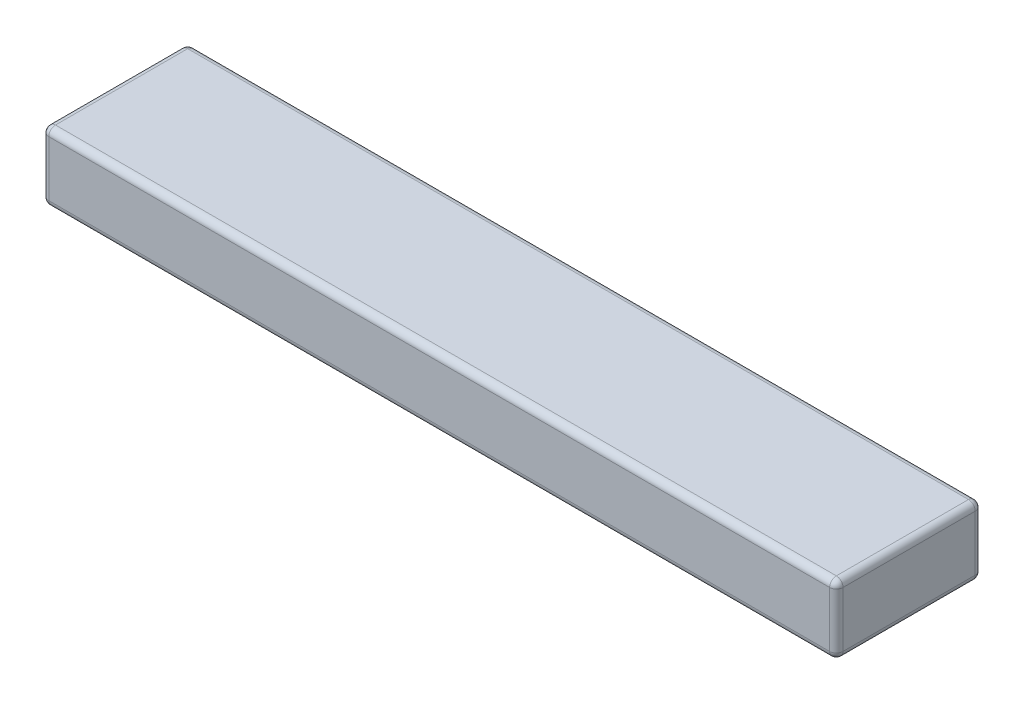
ISO-10303-21;
HEADER;
FILE_DESCRIPTION(('STEP AP214'),'2;1');
FILE_NAME('part.step','',(''),(''),'','','');
FILE_SCHEMA(('AUTOMOTIVE_DESIGN { 1 0 10303 214 1 1 1 1 }'));
ENDSEC;
DATA;
#1=APPLICATION_CONTEXT('core data for automotive mechanical design processes');
#2=APPLICATION_PROTOCOL_DEFINITION('international standard','automotive_design',2000,#1);
#3=PRODUCT_CONTEXT('',#1,'mechanical');
#4=PRODUCT('Part','Part','',(#3));
#5=PRODUCT_RELATED_PRODUCT_CATEGORY('part','',(#4));
#6=PRODUCT_DEFINITION_FORMATION('','',#4);
#7=PRODUCT_DEFINITION_CONTEXT('part definition',#1,'design');
#8=PRODUCT_DEFINITION('design','',#6,#7);
#9=PRODUCT_DEFINITION_SHAPE('','',#8);
#10=(LENGTH_UNIT() NAMED_UNIT(*) SI_UNIT(.MILLI.,.METRE.));
#11=(NAMED_UNIT(*) PLANE_ANGLE_UNIT() SI_UNIT($,.RADIAN.));
#12=(NAMED_UNIT(*) SI_UNIT($,.STERADIAN.) SOLID_ANGLE_UNIT());
#13=UNCERTAINTY_MEASURE_WITH_UNIT(LENGTH_MEASURE(1.E-05),#10,'distance_accuracy_value','');
#14=(GEOMETRIC_REPRESENTATION_CONTEXT(3) GLOBAL_UNCERTAINTY_ASSIGNED_CONTEXT((#13)) GLOBAL_UNIT_ASSIGNED_CONTEXT((#10,
#11,#12)) REPRESENTATION_CONTEXT('',''));
#15=CARTESIAN_POINT('',(0.,0.,0.));
#16=DIRECTION('',(0.,0.,1.));
#17=DIRECTION('',(1.,0.,0.));
#18=AXIS2_PLACEMENT_3D('',#15,#16,#17);
#19=CARTESIAN_POINT('',(-150.,26.,27.5));
#20=DIRECTION('',(1.,0.,0.));
#21=DIRECTION('',(0.,0.,-1.));
#22=AXIS2_PLACEMENT_3D('',#19,#20,#21);
#23=PLANE('',#22);
#24=DIRECTION('',(0.,-1.,0.));
#25=VECTOR('',#24,1.);
#26=CARTESIAN_POINT('',(-150.,26.,-24.96));
#27=LINE('',#26,#25);
#28=CARTESIAN_POINT('',(-150.,23.46,-24.96));
#29=VERTEX_POINT('',#28);
#30=CARTESIAN_POINT('',(-150.,2.54,-24.96));
#31=VERTEX_POINT('',#30);
#32=EDGE_CURVE('E130',#29,#31,#27,.T.);
#33=ORIENTED_EDGE('',*,*,#32,.T.);
#34=DIRECTION('',(0.,0.,1.));
#35=VECTOR('',#34,1.);
#36=CARTESIAN_POINT('',(-150.,2.54,27.5));
#37=LINE('',#36,#35);
#38=CARTESIAN_POINT('',(-150.,2.54,24.96));
#39=VERTEX_POINT('',#38);
#40=EDGE_CURVE('E126',#31,#39,#37,.T.);
#41=ORIENTED_EDGE('',*,*,#40,.T.);
#42=DIRECTION('',(0.,-1.,0.));
#43=VECTOR('',#42,1.);
#44=CARTESIAN_POINT('',(-150.,26.,24.96));
#45=LINE('',#44,#43);
#46=CARTESIAN_POINT('',(-150.,23.46,24.96));
#47=VERTEX_POINT('',#46);
#48=EDGE_CURVE('E121',#39,#47,#45,.F.);
#49=ORIENTED_EDGE('',*,*,#48,.T.);
#50=DIRECTION('',(0.,0.,1.));
#51=VECTOR('',#50,1.);
#52=CARTESIAN_POINT('',(-150.,23.46,-27.5));
#53=LINE('',#52,#51);
#54=EDGE_CURVE('E123',#47,#29,#53,.F.);
#55=ORIENTED_EDGE('',*,*,#54,.T.);
#56=EDGE_LOOP('',(#33,#41,#49,#55));
#57=FACE_BOUND('',#56,.T.);
#58=ADVANCED_FACE('F33',(#57),#23,.F.);
#59=CARTESIAN_POINT('',(150.,26.,27.5));
#60=DIRECTION('',(0.,0.,-1.));
#61=DIRECTION('',(-1.,0.,0.));
#62=AXIS2_PLACEMENT_3D('',#59,#60,#61);
#63=PLANE('',#62);
#64=DIRECTION('',(0.,-1.,0.));
#65=VECTOR('',#64,1.);
#66=CARTESIAN_POINT('',(-147.46,26.,27.5));
#67=LINE('',#66,#65);
#68=CARTESIAN_POINT('',(-147.46,23.46,27.5));
#69=VERTEX_POINT('',#68);
#70=CARTESIAN_POINT('',(-147.46,2.54,27.5));
#71=VERTEX_POINT('',#70);
#72=EDGE_CURVE('E152',#69,#71,#67,.T.);
#73=ORIENTED_EDGE('',*,*,#72,.T.);
#74=DIRECTION('',(1.,0.,0.));
#75=VECTOR('',#74,1.);
#76=CARTESIAN_POINT('',(150.,2.54,27.5));
#77=LINE('',#76,#75);
#78=CARTESIAN_POINT('',(147.46,2.54,27.5));
#79=VERTEX_POINT('',#78);
#80=EDGE_CURVE('E230',#71,#79,#77,.T.);
#81=ORIENTED_EDGE('',*,*,#80,.T.);
#82=DIRECTION('',(0.,-1.,0.));
#83=VECTOR('',#82,1.);
#84=CARTESIAN_POINT('',(147.46,26.,27.5));
#85=LINE('',#84,#83);
#86=CARTESIAN_POINT('',(147.46,23.46,27.5));
#87=VERTEX_POINT('',#86);
#88=EDGE_CURVE('E223',#79,#87,#85,.F.);
#89=ORIENTED_EDGE('',*,*,#88,.T.);
#90=DIRECTION('',(1.,0.,0.));
#91=VECTOR('',#90,1.);
#92=CARTESIAN_POINT('',(-150.,23.46,27.5));
#93=LINE('',#92,#91);
#94=EDGE_CURVE('E221',#87,#69,#93,.F.);
#95=ORIENTED_EDGE('',*,*,#94,.T.);
#96=EDGE_LOOP('',(#73,#81,#89,#95));
#97=FACE_BOUND('',#96,.T.);
#98=ADVANCED_FACE('F320',(#97),#63,.F.);
#99=CARTESIAN_POINT('',(150.,26.,27.5));
#100=DIRECTION('',(-1.,0.,0.));
#101=DIRECTION('',(0.,0.,1.));
#102=AXIS2_PLACEMENT_3D('',#99,#100,#101);
#103=PLANE('',#102);
#104=DIRECTION('',(0.,0.,-1.));
#105=VECTOR('',#104,1.);
#106=CARTESIAN_POINT('',(150.,2.54,27.5));
#107=LINE('',#106,#105);
#108=CARTESIAN_POINT('',(150.,2.54,24.96));
#109=VERTEX_POINT('',#108);
#110=CARTESIAN_POINT('',(150.,2.54,-24.96));
#111=VERTEX_POINT('',#110);
#112=EDGE_CURVE('E217',#109,#111,#107,.T.);
#113=ORIENTED_EDGE('',*,*,#112,.T.);
#114=DIRECTION('',(0.,-1.,0.));
#115=VECTOR('',#114,1.);
#116=CARTESIAN_POINT('',(150.,26.,-24.96));
#117=LINE('',#116,#115);
#118=CARTESIAN_POINT('',(150.,23.46,-24.96));
#119=VERTEX_POINT('',#118);
#120=EDGE_CURVE('E214',#111,#119,#117,.F.);
#121=ORIENTED_EDGE('',*,*,#120,.T.);
#122=DIRECTION('',(0.,0.,-1.));
#123=VECTOR('',#122,1.);
#124=CARTESIAN_POINT('',(150.,23.46,27.5));
#125=LINE('',#124,#123);
#126=CARTESIAN_POINT('',(150.,23.46,24.96));
#127=VERTEX_POINT('',#126);
#128=EDGE_CURVE('E207',#119,#127,#125,.F.);
#129=ORIENTED_EDGE('',*,*,#128,.T.);
#130=DIRECTION('',(0.,-1.,0.));
#131=VECTOR('',#130,1.);
#132=CARTESIAN_POINT('',(150.,26.,24.96));
#133=LINE('',#132,#131);
#134=EDGE_CURVE('E210',#127,#109,#133,.T.);
#135=ORIENTED_EDGE('',*,*,#134,.T.);
#136=EDGE_LOOP('',(#113,#121,#129,#135));
#137=FACE_BOUND('',#136,.T.);
#138=ADVANCED_FACE('F215',(#137),#103,.F.);
#139=CARTESIAN_POINT('',(150.,26.,-27.5));
#140=DIRECTION('',(0.,0.,1.));
#141=DIRECTION('',(1.,0.,0.));
#142=AXIS2_PLACEMENT_3D('',#139,#140,#141);
#143=PLANE('',#142);
#144=DIRECTION('',(-1.,0.,0.));
#145=VECTOR('',#144,1.);
#146=CARTESIAN_POINT('',(150.,2.54,-27.5));
#147=LINE('',#146,#145);
#148=CARTESIAN_POINT('',(147.46,2.54,-27.5));
#149=VERTEX_POINT('',#148);
#150=CARTESIAN_POINT('',(-147.46,2.54,-27.5));
#151=VERTEX_POINT('',#150);
#152=EDGE_CURVE('E279',#149,#151,#147,.T.);
#153=ORIENTED_EDGE('',*,*,#152,.T.);
#154=DIRECTION('',(0.,-1.,0.));
#155=VECTOR('',#154,1.);
#156=CARTESIAN_POINT('',(-147.46,26.,-27.5));
#157=LINE('',#156,#155);
#158=CARTESIAN_POINT('',(-147.46,23.46,-27.5));
#159=VERTEX_POINT('',#158);
#160=EDGE_CURVE('E211',#151,#159,#157,.F.);
#161=ORIENTED_EDGE('',*,*,#160,.T.);
#162=DIRECTION('',(-1.,0.,0.));
#163=VECTOR('',#162,1.);
#164=CARTESIAN_POINT('',(150.,23.46,-27.5));
#165=LINE('',#164,#163);
#166=CARTESIAN_POINT('',(147.46,23.46,-27.5));
#167=VERTEX_POINT('',#166);
#168=EDGE_CURVE('E272',#159,#167,#165,.F.);
#169=ORIENTED_EDGE('',*,*,#168,.T.);
#170=DIRECTION('',(0.,-1.,0.));
#171=VECTOR('',#170,1.);
#172=CARTESIAN_POINT('',(147.46,26.,-27.5));
#173=LINE('',#172,#171);
#174=EDGE_CURVE('E274',#167,#149,#173,.T.);
#175=ORIENTED_EDGE('',*,*,#174,.T.);
#176=EDGE_LOOP('',(#153,#161,#169,#175));
#177=FACE_BOUND('',#176,.T.);
#178=ADVANCED_FACE('F304',(#177),#143,.F.);
#179=CARTESIAN_POINT('',(-150.,26.,-27.5));
#180=DIRECTION('',(0.,1.,0.));
#181=DIRECTION('',(0.,0.,1.));
#182=AXIS2_PLACEMENT_3D('',#179,#180,#181);
#183=PLANE('',#182);
#184=DIRECTION('',(0.,0.,-1.));
#185=VECTOR('',#184,1.);
#186=CARTESIAN_POINT('',(147.46,26.,-27.5));
#187=LINE('',#186,#185);
#188=CARTESIAN_POINT('',(147.46,26.,24.96));
#189=VERTEX_POINT('',#188);
#190=CARTESIAN_POINT('',(147.46,26.,-24.96));
#191=VERTEX_POINT('',#190);
#192=EDGE_CURVE('E42',#189,#191,#187,.T.);
#193=ORIENTED_EDGE('',*,*,#192,.T.);
#194=DIRECTION('',(-1.,0.,0.));
#195=VECTOR('',#194,1.);
#196=CARTESIAN_POINT('',(-150.,26.,-24.96));
#197=LINE('',#196,#195);
#198=CARTESIAN_POINT('',(-147.46,26.,-24.96));
#199=VERTEX_POINT('',#198);
#200=EDGE_CURVE('E11',#191,#199,#197,.T.);
#201=ORIENTED_EDGE('',*,*,#200,.T.);
#202=DIRECTION('',(0.,0.,1.));
#203=VECTOR('',#202,1.);
#204=CARTESIAN_POINT('',(-147.46,26.,27.5));
#205=LINE('',#204,#203);
#206=CARTESIAN_POINT('',(-147.46,26.,24.96));
#207=VERTEX_POINT('',#206);
#208=EDGE_CURVE('E232',#199,#207,#205,.T.);
#209=ORIENTED_EDGE('',*,*,#208,.T.);
#210=DIRECTION('',(1.,0.,0.));
#211=VECTOR('',#210,1.);
#212=CARTESIAN_POINT('',(150.,26.,24.96));
#213=LINE('',#212,#211);
#214=EDGE_CURVE('E53',#207,#189,#213,.T.);
#215=ORIENTED_EDGE('',*,*,#214,.T.);
#216=EDGE_LOOP('',(#193,#201,#209,#215));
#217=FACE_BOUND('',#216,.T.);
#218=ADVANCED_FACE('F483',(#217),#183,.T.);
#219=CARTESIAN_POINT('',(-150.,0.,-27.5));
#220=DIRECTION('',(0.,1.,0.));
#221=DIRECTION('',(0.,0.,1.));
#222=AXIS2_PLACEMENT_3D('',#219,#220,#221);
#223=PLANE('',#222);
#224=DIRECTION('',(1.,0.,0.));
#225=VECTOR('',#224,1.);
#226=CARTESIAN_POINT('',(-150.,0.,24.96));
#227=LINE('',#226,#225);
#228=CARTESIAN_POINT('',(147.46,0.,24.96));
#229=VERTEX_POINT('',#228);
#230=CARTESIAN_POINT('',(-147.46,0.,24.96));
#231=VERTEX_POINT('',#230);
#232=EDGE_CURVE('E268',#229,#231,#227,.F.);
#233=ORIENTED_EDGE('',*,*,#232,.T.);
#234=DIRECTION('',(0.,0.,1.));
#235=VECTOR('',#234,1.);
#236=CARTESIAN_POINT('',(-147.46,0.,-27.5));
#237=LINE('',#236,#235);
#238=CARTESIAN_POINT('',(-147.46,0.,-24.96));
#239=VERTEX_POINT('',#238);
#240=EDGE_CURVE('E262',#231,#239,#237,.F.);
#241=ORIENTED_EDGE('',*,*,#240,.T.);
#242=DIRECTION('',(-1.,0.,0.));
#243=VECTOR('',#242,1.);
#244=CARTESIAN_POINT('',(-150.,0.,-24.96));
#245=LINE('',#244,#243);
#246=CARTESIAN_POINT('',(147.46,0.,-24.96));
#247=VERTEX_POINT('',#246);
#248=EDGE_CURVE('E256',#239,#247,#245,.F.);
#249=ORIENTED_EDGE('',*,*,#248,.T.);
#250=DIRECTION('',(0.,0.,-1.));
#251=VECTOR('',#250,1.);
#252=CARTESIAN_POINT('',(147.46,0.,-27.5));
#253=LINE('',#252,#251);
#254=EDGE_CURVE('E263',#247,#229,#253,.F.);
#255=ORIENTED_EDGE('',*,*,#254,.T.);
#256=EDGE_LOOP('',(#233,#241,#249,#255));
#257=FACE_BOUND('',#256,.T.);
#258=ADVANCED_FACE('F266',(#257),#223,.F.);
#259=CARTESIAN_POINT('',(147.46,23.46,-27.5));
#260=DIRECTION('',(0.,0.,1.));
#261=DIRECTION('',(1.,0.,0.));
#262=AXIS2_PLACEMENT_3D('',#259,#260,#261);
#263=CYLINDRICAL_SURFACE('',#262,2.54);
#264=CARTESIAN_POINT('',(147.46,23.46,-24.96));
#265=DIRECTION('',(0.,0.,-1.));
#266=DIRECTION('',(-1.,0.,0.));
#267=AXIS2_PLACEMENT_3D('',#264,#265,#266);
#268=CIRCLE('',#267,2.54);
#269=EDGE_CURVE('E37',#191,#119,#268,.T.);
#270=ORIENTED_EDGE('',*,*,#269,.F.);
#271=ORIENTED_EDGE('',*,*,#192,.F.);
#272=CARTESIAN_POINT('',(147.46,23.46,24.96));
#273=DIRECTION('',(0.,0.,1.));
#274=DIRECTION('',(1.,0.,0.));
#275=AXIS2_PLACEMENT_3D('',#272,#273,#274);
#276=CIRCLE('',#275,2.54);
#277=EDGE_CURVE('E192',#127,#189,#276,.T.);
#278=ORIENTED_EDGE('',*,*,#277,.F.);
#279=ORIENTED_EDGE('',*,*,#128,.F.);
#280=EDGE_LOOP('',(#270,#271,#278,#279));
#281=FACE_BOUND('',#280,.T.);
#282=ADVANCED_FACE('F35',(#281),#263,.T.);
#283=CARTESIAN_POINT('',(147.46,23.46,-24.96));
#284=DIRECTION('',(0.,0.,1.));
#285=DIRECTION('',(1.,0.,0.));
#286=AXIS2_PLACEMENT_3D('',#283,#284,#285);
#287=SPHERICAL_SURFACE('',#286,2.54);
#288=CARTESIAN_POINT('',(147.46,23.46,-24.96));
#289=DIRECTION('',(1.,0.,0.));
#290=DIRECTION('',(0.,0.,-1.));
#291=AXIS2_PLACEMENT_3D('',#288,#289,#290);
#292=CIRCLE('',#291,2.54);
#293=EDGE_CURVE('E188',#191,#167,#292,.F.);
#294=ORIENTED_EDGE('',*,*,#293,.F.);
#295=ORIENTED_EDGE('',*,*,#269,.T.);
#296=CARTESIAN_POINT('',(147.46,23.46,-24.96));
#297=DIRECTION('',(0.,1.,0.));
#298=DIRECTION('',(0.,0.,1.));
#299=AXIS2_PLACEMENT_3D('',#296,#297,#298);
#300=CIRCLE('',#299,2.54);
#301=EDGE_CURVE('E191',#167,#119,#300,.F.);
#302=ORIENTED_EDGE('',*,*,#301,.F.);
#303=EDGE_LOOP('',(#294,#295,#302));
#304=FACE_BOUND('',#303,.T.);
#305=ADVANCED_FACE('F203',(#304),#287,.T.);
#306=CARTESIAN_POINT('',(147.46,23.46,24.96));
#307=DIRECTION('',(0.,0.,1.));
#308=DIRECTION('',(1.,0.,0.));
#309=AXIS2_PLACEMENT_3D('',#306,#307,#308);
#310=SPHERICAL_SURFACE('',#309,2.54);
#311=CARTESIAN_POINT('',(147.46,23.46,24.96));
#312=DIRECTION('',(0.,1.,0.));
#313=DIRECTION('',(0.,0.,1.));
#314=AXIS2_PLACEMENT_3D('',#311,#312,#313);
#315=CIRCLE('',#314,2.54);
#316=EDGE_CURVE('E182',#127,#87,#315,.F.);
#317=ORIENTED_EDGE('',*,*,#316,.F.);
#318=ORIENTED_EDGE('',*,*,#277,.T.);
#319=CARTESIAN_POINT('',(147.46,23.46,24.96));
#320=DIRECTION('',(1.,0.,0.));
#321=DIRECTION('',(0.,0.,-1.));
#322=AXIS2_PLACEMENT_3D('',#319,#320,#321);
#323=CIRCLE('',#322,2.54);
#324=EDGE_CURVE('E185',#87,#189,#323,.F.);
#325=ORIENTED_EDGE('',*,*,#324,.F.);
#326=EDGE_LOOP('',(#317,#318,#325));
#327=FACE_BOUND('',#326,.T.);
#328=ADVANCED_FACE('F456',(#327),#310,.T.);
#329=CARTESIAN_POINT('',(147.46,26.,-24.96));
#330=DIRECTION('',(0.,-1.,0.));
#331=DIRECTION('',(0.,0.,-1.));
#332=AXIS2_PLACEMENT_3D('',#329,#330,#331);
#333=CYLINDRICAL_SURFACE('',#332,2.54);
#334=ORIENTED_EDGE('',*,*,#301,.T.);
#335=ORIENTED_EDGE('',*,*,#120,.F.);
#336=CARTESIAN_POINT('',(147.46,2.54,-24.96));
#337=DIRECTION('',(0.,-1.,0.));
#338=DIRECTION('',(0.,0.,-1.));
#339=AXIS2_PLACEMENT_3D('',#336,#337,#338);
#340=CIRCLE('',#339,2.54);
#341=EDGE_CURVE('E176',#149,#111,#340,.T.);
#342=ORIENTED_EDGE('',*,*,#341,.F.);
#343=ORIENTED_EDGE('',*,*,#174,.F.);
#344=EDGE_LOOP('',(#334,#335,#342,#343));
#345=FACE_BOUND('',#344,.T.);
#346=ADVANCED_FACE('F306',(#345),#333,.T.);
#347=CARTESIAN_POINT('',(-150.,23.46,-24.96));
#348=DIRECTION('',(1.,0.,0.));
#349=DIRECTION('',(0.,0.,-1.));
#350=AXIS2_PLACEMENT_3D('',#347,#348,#349);
#351=CYLINDRICAL_SURFACE('',#350,2.54);
#352=ORIENTED_EDGE('',*,*,#293,.T.);
#353=ORIENTED_EDGE('',*,*,#168,.F.);
#354=CARTESIAN_POINT('',(-147.46,23.46,-24.96));
#355=DIRECTION('',(-1.,0.,0.));
#356=DIRECTION('',(0.,0.,1.));
#357=AXIS2_PLACEMENT_3D('',#354,#355,#356);
#358=CIRCLE('',#357,2.54);
#359=EDGE_CURVE('E173',#199,#159,#358,.T.);
#360=ORIENTED_EDGE('',*,*,#359,.F.);
#361=ORIENTED_EDGE('',*,*,#200,.F.);
#362=EDGE_LOOP('',(#352,#353,#360,#361));
#363=FACE_BOUND('',#362,.T.);
#364=ADVANCED_FACE('F440',(#363),#351,.T.);
#365=CARTESIAN_POINT('',(-147.46,23.46,-27.5));
#366=DIRECTION('',(0.,0.,-1.));
#367=DIRECTION('',(-1.,0.,0.));
#368=AXIS2_PLACEMENT_3D('',#365,#366,#367);
#369=CYLINDRICAL_SURFACE('',#368,2.54);
#370=CARTESIAN_POINT('',(-147.46,23.46,24.96));
#371=DIRECTION('',(0.,0.,1.));
#372=DIRECTION('',(1.,0.,0.));
#373=AXIS2_PLACEMENT_3D('',#370,#371,#372);
#374=CIRCLE('',#373,2.54);
#375=EDGE_CURVE('E137',#207,#47,#374,.T.);
#376=ORIENTED_EDGE('',*,*,#375,.F.);
#377=ORIENTED_EDGE('',*,*,#208,.F.);
#378=CARTESIAN_POINT('',(-147.46,23.46,-24.96));
#379=DIRECTION('',(0.,0.,-1.));
#380=DIRECTION('',(-1.,0.,0.));
#381=AXIS2_PLACEMENT_3D('',#378,#379,#380);
#382=CIRCLE('',#381,2.54);
#383=EDGE_CURVE('E139',#29,#199,#382,.T.);
#384=ORIENTED_EDGE('',*,*,#383,.F.);
#385=ORIENTED_EDGE('',*,*,#54,.F.);
#386=EDGE_LOOP('',(#376,#377,#384,#385));
#387=FACE_BOUND('',#386,.T.);
#388=ADVANCED_FACE('F135',(#387),#369,.T.);
#389=CARTESIAN_POINT('',(-150.,23.46,24.96));
#390=DIRECTION('',(-1.,0.,0.));
#391=DIRECTION('',(0.,0.,1.));
#392=AXIS2_PLACEMENT_3D('',#389,#390,#391);
#393=CYLINDRICAL_SURFACE('',#392,2.54);
#394=ORIENTED_EDGE('',*,*,#324,.T.);
#395=ORIENTED_EDGE('',*,*,#214,.F.);
#396=CARTESIAN_POINT('',(-147.46,23.46,24.96));
#397=DIRECTION('',(-1.,0.,0.));
#398=DIRECTION('',(0.,-1.,0.));
#399=AXIS2_PLACEMENT_3D('',#396,#397,#398);
#400=CIRCLE('',#399,2.54);
#401=EDGE_CURVE('E148',#69,#207,#400,.T.);
#402=ORIENTED_EDGE('',*,*,#401,.F.);
#403=ORIENTED_EDGE('',*,*,#94,.F.);
#404=EDGE_LOOP('',(#394,#395,#402,#403));
#405=FACE_BOUND('',#404,.T.);
#406=ADVANCED_FACE('F424',(#405),#393,.T.);
#407=CARTESIAN_POINT('',(147.46,26.,24.96));
#408=DIRECTION('',(0.,-1.,0.));
#409=DIRECTION('',(0.,0.,-1.));
#410=AXIS2_PLACEMENT_3D('',#407,#408,#409);
#411=CYLINDRICAL_SURFACE('',#410,2.54);
#412=ORIENTED_EDGE('',*,*,#316,.T.);
#413=ORIENTED_EDGE('',*,*,#88,.F.);
#414=CARTESIAN_POINT('',(147.46,2.54,24.96));
#415=DIRECTION('',(0.,-1.,0.));
#416=DIRECTION('',(0.,0.,-1.));
#417=AXIS2_PLACEMENT_3D('',#414,#415,#416);
#418=CIRCLE('',#417,2.54);
#419=EDGE_CURVE('E168',#109,#79,#418,.T.);
#420=ORIENTED_EDGE('',*,*,#419,.F.);
#421=ORIENTED_EDGE('',*,*,#134,.F.);
#422=EDGE_LOOP('',(#412,#413,#420,#421));
#423=FACE_BOUND('',#422,.T.);
#424=ADVANCED_FACE('F290',(#423),#411,.T.);
#425=CARTESIAN_POINT('',(147.46,2.54,27.5));
#426=DIRECTION('',(0.,0.,-1.));
#427=DIRECTION('',(-1.,0.,0.));
#428=AXIS2_PLACEMENT_3D('',#425,#426,#427);
#429=CYLINDRICAL_SURFACE('',#428,2.54);
#430=CARTESIAN_POINT('',(147.46,2.54,-24.96));
#431=DIRECTION('',(0.,0.,-1.));
#432=DIRECTION('',(-1.,0.,0.));
#433=AXIS2_PLACEMENT_3D('',#430,#431,#432);
#434=CIRCLE('',#433,2.54);
#435=EDGE_CURVE('E179',#111,#247,#434,.T.);
#436=ORIENTED_EDGE('',*,*,#435,.F.);
#437=ORIENTED_EDGE('',*,*,#112,.F.);
#438=CARTESIAN_POINT('',(147.46,2.54,24.96));
#439=DIRECTION('',(0.,0.,1.));
#440=DIRECTION('',(1.,0.,0.));
#441=AXIS2_PLACEMENT_3D('',#438,#439,#440);
#442=CIRCLE('',#441,2.54);
#443=EDGE_CURVE('E165',#229,#109,#442,.T.);
#444=ORIENTED_EDGE('',*,*,#443,.F.);
#445=ORIENTED_EDGE('',*,*,#254,.F.);
#446=EDGE_LOOP('',(#436,#437,#444,#445));
#447=FACE_BOUND('',#446,.T.);
#448=ADVANCED_FACE('F287',(#447),#429,.T.);
#449=CARTESIAN_POINT('',(147.46,2.54,-24.96));
#450=DIRECTION('',(0.,0.,1.));
#451=DIRECTION('',(1.,0.,0.));
#452=AXIS2_PLACEMENT_3D('',#449,#450,#451);
#453=SPHERICAL_SURFACE('',#452,2.54);
#454=ORIENTED_EDGE('',*,*,#341,.T.);
#455=ORIENTED_EDGE('',*,*,#435,.T.);
#456=CARTESIAN_POINT('',(147.46,2.54,-24.96));
#457=DIRECTION('',(1.,0.,0.));
#458=DIRECTION('',(0.,0.,-1.));
#459=AXIS2_PLACEMENT_3D('',#456,#457,#458);
#460=CIRCLE('',#459,2.54);
#461=EDGE_CURVE('E156',#149,#247,#460,.F.);
#462=ORIENTED_EDGE('',*,*,#461,.F.);
#463=EDGE_LOOP('',(#454,#455,#462));
#464=FACE_BOUND('',#463,.T.);
#465=ADVANCED_FACE('F308',(#464),#453,.T.);
#466=CARTESIAN_POINT('',(-147.46,23.46,-24.96));
#467=DIRECTION('',(0.,0.,1.));
#468=DIRECTION('',(1.,0.,0.));
#469=AXIS2_PLACEMENT_3D('',#466,#467,#468);
#470=SPHERICAL_SURFACE('',#469,2.54);
#471=ORIENTED_EDGE('',*,*,#383,.T.);
#472=ORIENTED_EDGE('',*,*,#359,.T.);
#473=CARTESIAN_POINT('',(-147.46,23.46,-24.96));
#474=DIRECTION('',(0.,1.,0.));
#475=DIRECTION('',(0.,0.,1.));
#476=AXIS2_PLACEMENT_3D('',#473,#474,#475);
#477=CIRCLE('',#476,2.54);
#478=EDGE_CURVE('E153',#29,#159,#477,.F.);
#479=ORIENTED_EDGE('',*,*,#478,.F.);
#480=EDGE_LOOP('',(#471,#472,#479));
#481=FACE_BOUND('',#480,.T.);
#482=ADVANCED_FACE('F310',(#481),#470,.T.);
#483=CARTESIAN_POINT('',(-147.46,23.46,24.96));
#484=DIRECTION('',(0.,0.,1.));
#485=DIRECTION('',(1.,0.,0.));
#486=AXIS2_PLACEMENT_3D('',#483,#484,#485);
#487=SPHERICAL_SURFACE('',#486,2.54);
#488=ORIENTED_EDGE('',*,*,#401,.T.);
#489=ORIENTED_EDGE('',*,*,#375,.T.);
#490=CARTESIAN_POINT('',(-147.46,23.46,24.96));
#491=DIRECTION('',(0.,1.,0.));
#492=DIRECTION('',(0.,0.,1.));
#493=AXIS2_PLACEMENT_3D('',#490,#491,#492);
#494=CIRCLE('',#493,2.54);
#495=EDGE_CURVE('E145',#69,#47,#494,.F.);
#496=ORIENTED_EDGE('',*,*,#495,.F.);
#497=EDGE_LOOP('',(#488,#489,#496));
#498=FACE_BOUND('',#497,.T.);
#499=ADVANCED_FACE('F144',(#498),#487,.T.);
#500=CARTESIAN_POINT('',(147.46,2.54,24.96));
#501=DIRECTION('',(0.,0.,1.));
#502=DIRECTION('',(1.,0.,0.));
#503=AXIS2_PLACEMENT_3D('',#500,#501,#502);
#504=SPHERICAL_SURFACE('',#503,2.54);
#505=ORIENTED_EDGE('',*,*,#443,.T.);
#506=ORIENTED_EDGE('',*,*,#419,.T.);
#507=CARTESIAN_POINT('',(147.46,2.54,24.96));
#508=DIRECTION('',(1.,0.,0.));
#509=DIRECTION('',(0.,0.,-1.));
#510=AXIS2_PLACEMENT_3D('',#507,#508,#509);
#511=CIRCLE('',#510,2.54);
#512=EDGE_CURVE('E154',#229,#79,#511,.F.);
#513=ORIENTED_EDGE('',*,*,#512,.F.);
#514=EDGE_LOOP('',(#505,#506,#513));
#515=FACE_BOUND('',#514,.T.);
#516=ADVANCED_FACE('F292',(#515),#504,.T.);
#517=CARTESIAN_POINT('',(150.,2.54,-24.96));
#518=DIRECTION('',(-1.,0.,0.));
#519=DIRECTION('',(0.,0.,1.));
#520=AXIS2_PLACEMENT_3D('',#517,#518,#519);
#521=CYLINDRICAL_SURFACE('',#520,2.54);
#522=ORIENTED_EDGE('',*,*,#461,.T.);
#523=ORIENTED_EDGE('',*,*,#248,.F.);
#524=CARTESIAN_POINT('',(-147.46,2.54,-24.96));
#525=DIRECTION('',(-1.,0.,0.));
#526=DIRECTION('',(0.,0.,1.));
#527=AXIS2_PLACEMENT_3D('',#524,#525,#526);
#528=CIRCLE('',#527,2.54);
#529=EDGE_CURVE('E159',#151,#239,#528,.T.);
#530=ORIENTED_EDGE('',*,*,#529,.F.);
#531=ORIENTED_EDGE('',*,*,#152,.F.);
#532=EDGE_LOOP('',(#522,#523,#530,#531));
#533=FACE_BOUND('',#532,.T.);
#534=ADVANCED_FACE('F258',(#533),#521,.T.);
#535=CARTESIAN_POINT('',(-147.46,26.,-24.96));
#536=DIRECTION('',(0.,-1.,0.));
#537=DIRECTION('',(0.,0.,-1.));
#538=AXIS2_PLACEMENT_3D('',#535,#536,#537);
#539=CYLINDRICAL_SURFACE('',#538,2.54);
#540=ORIENTED_EDGE('',*,*,#478,.T.);
#541=ORIENTED_EDGE('',*,*,#160,.F.);
#542=CARTESIAN_POINT('',(-147.46,2.54,-24.96));
#543=DIRECTION('',(0.,-1.,0.));
#544=DIRECTION('',(0.,0.,-1.));
#545=AXIS2_PLACEMENT_3D('',#542,#543,#544);
#546=CIRCLE('',#545,2.54);
#547=EDGE_CURVE('E245',#31,#151,#546,.T.);
#548=ORIENTED_EDGE('',*,*,#547,.F.);
#549=ORIENTED_EDGE('',*,*,#32,.F.);
#550=EDGE_LOOP('',(#540,#541,#548,#549));
#551=FACE_BOUND('',#550,.T.);
#552=ADVANCED_FACE('F302',(#551),#539,.T.);
#553=CARTESIAN_POINT('',(-147.46,26.,24.96));
#554=DIRECTION('',(0.,-1.,0.));
#555=DIRECTION('',(0.,0.,-1.));
#556=AXIS2_PLACEMENT_3D('',#553,#554,#555);
#557=CYLINDRICAL_SURFACE('',#556,2.54);
#558=ORIENTED_EDGE('',*,*,#495,.T.);
#559=ORIENTED_EDGE('',*,*,#48,.F.);
#560=CARTESIAN_POINT('',(-147.46,2.54,24.96));
#561=DIRECTION('',(0.,-1.,0.));
#562=DIRECTION('',(0.,0.,-1.));
#563=AXIS2_PLACEMENT_3D('',#560,#561,#562);
#564=CIRCLE('',#563,2.54);
#565=EDGE_CURVE('E242',#71,#39,#564,.T.);
#566=ORIENTED_EDGE('',*,*,#565,.F.);
#567=ORIENTED_EDGE('',*,*,#72,.F.);
#568=EDGE_LOOP('',(#558,#559,#566,#567));
#569=FACE_BOUND('',#568,.T.);
#570=ADVANCED_FACE('F150',(#569),#557,.T.);
#571=CARTESIAN_POINT('',(150.,2.54,24.96));
#572=DIRECTION('',(1.,0.,0.));
#573=DIRECTION('',(0.,0.,-1.));
#574=AXIS2_PLACEMENT_3D('',#571,#572,#573);
#575=CYLINDRICAL_SURFACE('',#574,2.54);
#576=ORIENTED_EDGE('',*,*,#512,.T.);
#577=ORIENTED_EDGE('',*,*,#80,.F.);
#578=CARTESIAN_POINT('',(-147.46,2.54,24.96));
#579=DIRECTION('',(-1.,0.,0.));
#580=DIRECTION('',(0.,0.,1.));
#581=AXIS2_PLACEMENT_3D('',#578,#579,#580);
#582=CIRCLE('',#581,2.54);
#583=EDGE_CURVE('E240',#231,#71,#582,.T.);
#584=ORIENTED_EDGE('',*,*,#583,.F.);
#585=ORIENTED_EDGE('',*,*,#232,.F.);
#586=EDGE_LOOP('',(#576,#577,#584,#585));
#587=FACE_BOUND('',#586,.T.);
#588=ADVANCED_FACE('F295',(#587),#575,.T.);
#589=CARTESIAN_POINT('',(-147.46,2.54,-24.96));
#590=DIRECTION('',(0.,0.,1.));
#591=DIRECTION('',(1.,0.,0.));
#592=AXIS2_PLACEMENT_3D('',#589,#590,#591);
#593=SPHERICAL_SURFACE('',#592,2.54);
#594=ORIENTED_EDGE('',*,*,#547,.T.);
#595=ORIENTED_EDGE('',*,*,#529,.T.);
#596=CARTESIAN_POINT('',(-147.46,2.54,-24.96));
#597=DIRECTION('',(0.,0.,-1.));
#598=DIRECTION('',(-1.,0.,0.));
#599=AXIS2_PLACEMENT_3D('',#596,#597,#598);
#600=CIRCLE('',#599,2.54);
#601=EDGE_CURVE('E238',#31,#239,#600,.F.);
#602=ORIENTED_EDGE('',*,*,#601,.F.);
#603=EDGE_LOOP('',(#594,#595,#602));
#604=FACE_BOUND('',#603,.T.);
#605=ADVANCED_FACE('F252',(#604),#593,.T.);
#606=CARTESIAN_POINT('',(-147.46,2.54,24.96));
#607=DIRECTION('',(0.,0.,1.));
#608=DIRECTION('',(1.,0.,0.));
#609=AXIS2_PLACEMENT_3D('',#606,#607,#608);
#610=SPHERICAL_SURFACE('',#609,2.54);
#611=ORIENTED_EDGE('',*,*,#583,.T.);
#612=ORIENTED_EDGE('',*,*,#565,.T.);
#613=CARTESIAN_POINT('',(-147.46,2.54,24.96));
#614=DIRECTION('',(0.,0.,1.));
#615=DIRECTION('',(1.,0.,0.));
#616=AXIS2_PLACEMENT_3D('',#613,#614,#615);
#617=CIRCLE('',#616,2.54);
#618=EDGE_CURVE('E236',#231,#39,#617,.F.);
#619=ORIENTED_EDGE('',*,*,#618,.F.);
#620=EDGE_LOOP('',(#611,#612,#619));
#621=FACE_BOUND('',#620,.T.);
#622=ADVANCED_FACE('F332',(#621),#610,.T.);
#623=CARTESIAN_POINT('',(-147.46,2.54,27.5));
#624=DIRECTION('',(0.,0.,1.));
#625=DIRECTION('',(1.,0.,0.));
#626=AXIS2_PLACEMENT_3D('',#623,#624,#625);
#627=CYLINDRICAL_SURFACE('',#626,2.54);
#628=ORIENTED_EDGE('',*,*,#601,.T.);
#629=ORIENTED_EDGE('',*,*,#240,.F.);
#630=ORIENTED_EDGE('',*,*,#618,.T.);
#631=ORIENTED_EDGE('',*,*,#40,.F.);
#632=EDGE_LOOP('',(#628,#629,#630,#631));
#633=FACE_BOUND('',#632,.T.);
#634=ADVANCED_FACE('F329',(#633),#627,.T.);
#635=CLOSED_SHELL('',(#58,#98,#138,#178,#218,#258,#282,#305,#328,#346,#364,#388,#406,#424,#448,
#465,#482,#499,#516,#534,#552,#570,#588,#605,#622,#634));
#636=MANIFOLD_SOLID_BREP('B2',#635);
#637=ADVANCED_BREP_SHAPE_REPRESENTATION('',(#18,#636),#14);
#638=SHAPE_DEFINITION_REPRESENTATION(#9,#637);
ENDSEC;
END-ISO-10303-21;
